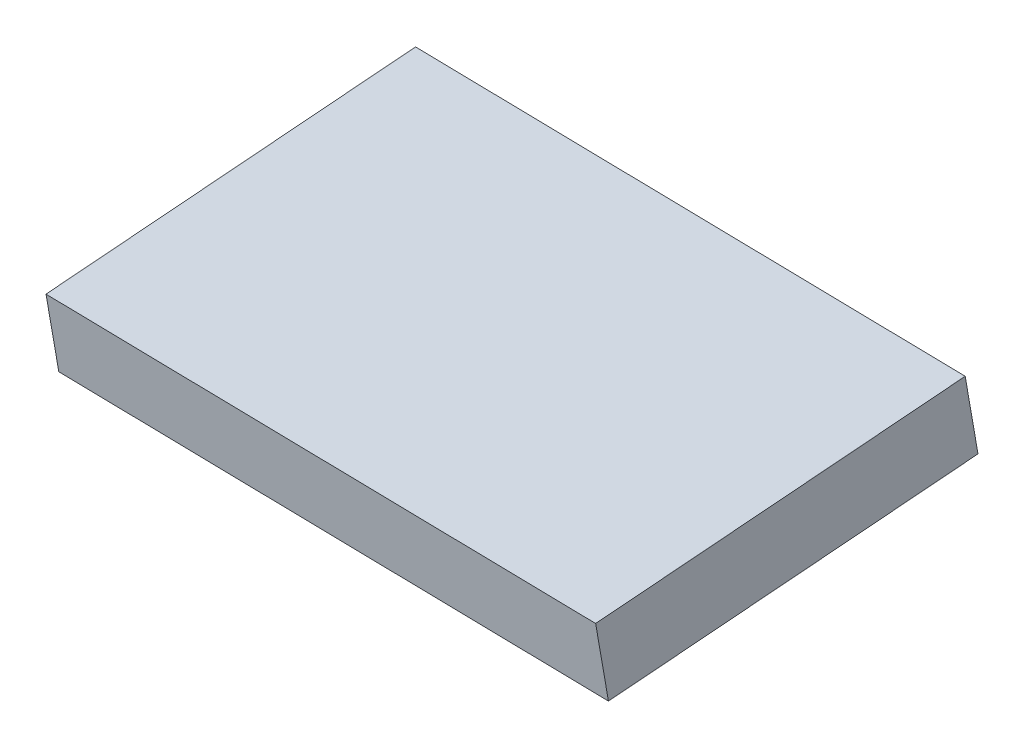
ISO-10303-21;
HEADER;
FILE_DESCRIPTION(('STEP AP214'),'2;1');
FILE_NAME('part.step','',(''),(''),'','','');
FILE_SCHEMA(('AUTOMOTIVE_DESIGN { 1 0 10303 214 1 1 1 1 }'));
ENDSEC;
DATA;
#1=APPLICATION_CONTEXT('core data for automotive mechanical design processes');
#2=APPLICATION_PROTOCOL_DEFINITION('international standard','automotive_design',2000,#1);
#3=PRODUCT_CONTEXT('',#1,'mechanical');
#4=PRODUCT('Part','Part','',(#3));
#5=PRODUCT_RELATED_PRODUCT_CATEGORY('part','',(#4));
#6=PRODUCT_DEFINITION_FORMATION('','',#4);
#7=PRODUCT_DEFINITION_CONTEXT('part definition',#1,'design');
#8=PRODUCT_DEFINITION('design','',#6,#7);
#9=PRODUCT_DEFINITION_SHAPE('','',#8);
#10=(LENGTH_UNIT() NAMED_UNIT(*) SI_UNIT(.MILLI.,.METRE.));
#11=(NAMED_UNIT(*) PLANE_ANGLE_UNIT() SI_UNIT($,.RADIAN.));
#12=(NAMED_UNIT(*) SI_UNIT($,.STERADIAN.) SOLID_ANGLE_UNIT());
#13=UNCERTAINTY_MEASURE_WITH_UNIT(LENGTH_MEASURE(1.E-05),#10,'distance_accuracy_value','');
#14=(GEOMETRIC_REPRESENTATION_CONTEXT(3) GLOBAL_UNCERTAINTY_ASSIGNED_CONTEXT((#13)) GLOBAL_UNIT_ASSIGNED_CONTEXT((#10,
#11,#12)) REPRESENTATION_CONTEXT('',''));
#15=CARTESIAN_POINT('',(0.,0.,0.));
#16=DIRECTION('',(0.,0.,1.));
#17=DIRECTION('',(1.,0.,0.));
#18=AXIS2_PLACEMENT_3D('',#15,#16,#17);
#19=CARTESIAN_POINT('',(6.04205053191705,502.2183131718,126.180705529089));
#20=DIRECTION('',(0.997472718226184,0.0405450658339127,0.0583461569513515));
#21=DIRECTION('',(0.0583941738534485,0.,-0.998293604336907));
#22=AXIS2_PLACEMENT_3D('',#19,#20,#21);
#23=PLANE('',#22);
#24=DIRECTION('',(-0.0523867977596558,-0.135065746400959,0.989450790878273));
#25=VECTOR('',#24,1.);
#26=CARTESIAN_POINT('',(6.11519935391046,500.709542902703,125.978622563627));
#27=LINE('',#26,#25);
#28=CARTESIAN_POINT('',(6.51438675283903,501.738743890279,118.439007537135));
#29=VERTEX_POINT('',#28);
#30=CARTESIAN_POINT('',(6.11519935391046,500.709542902703,125.978622563627));
#31=VERTEX_POINT('',#30);
#32=EDGE_CURVE('E100',#29,#31,#27,.T.);
#33=ORIENTED_EDGE('',*,*,#32,.F.);
#34=DIRECTION('',(0.0479979146938385,-0.990006738252662,-0.132600371037821));
#35=VECTOR('',#34,1.);
#36=CARTESIAN_POINT('',(6.44123793084562,503.247514159376,118.641090502596));
#37=LINE('',#36,#35);
#38=CARTESIAN_POINT('',(6.44123793084562,503.247514159376,118.641090502596));
#39=VERTEX_POINT('',#38);
#40=EDGE_CURVE('E11',#39,#29,#37,.T.);
#41=ORIENTED_EDGE('',*,*,#40,.F.);
#42=DIRECTION('',(-0.0523867977596558,-0.135065746400959,0.989450790878273));
#43=VECTOR('',#42,1.);
#44=CARTESIAN_POINT('',(6.04205053191705,502.2183131718,126.180705529089));
#45=LINE('',#44,#43);
#46=CARTESIAN_POINT('',(6.04205053191705,502.2183131718,126.180705529089));
#47=VERTEX_POINT('',#46);
#48=EDGE_CURVE('E94',#39,#47,#45,.T.);
#49=ORIENTED_EDGE('',*,*,#48,.T.);
#50=DIRECTION('',(0.0479979146938385,-0.990006738252662,-0.132600371037821));
#51=VECTOR('',#50,1.);
#52=CARTESIAN_POINT('',(6.04205053191705,502.2183131718,126.180705529089));
#53=LINE('',#52,#51);
#54=EDGE_CURVE('E39',#47,#31,#53,.T.);
#55=ORIENTED_EDGE('',*,*,#54,.T.);
#56=EDGE_LOOP('',(#33,#41,#49,#55));
#57=FACE_BOUND('',#56,.T.);
#58=ADVANCED_FACE('F36',(#57),#23,.T.);
#59=CARTESIAN_POINT('',(6.44123793084562,503.247514159376,118.641090502596));
#60=DIRECTION('',(0.0523867977596561,0.13506574640096,-0.989450790878273));
#61=DIRECTION('',(0.,0.990811304629671,0.135251464384124));
#62=AXIS2_PLACEMENT_3D('',#59,#60,#61);
#63=PLANE('',#62);
#64=DIRECTION('',(0.997472718226184,0.0405450658339065,0.0583461569513511));
#65=VECTOR('',#64,1.);
#66=CARTESIAN_POINT('',(6.51438675283903,501.738743890279,118.439007537135));
#67=LINE('',#66,#65);
#68=CARTESIAN_POINT('',(-6.02683773341877,501.228970777549,117.705421305785));
#69=VERTEX_POINT('',#68);
#70=EDGE_CURVE('E96',#69,#29,#67,.T.);
#71=ORIENTED_EDGE('',*,*,#70,.F.);
#72=DIRECTION('',(0.0479979146938385,-0.990006738252662,-0.132600371037821));
#73=VECTOR('',#72,1.);
#74=CARTESIAN_POINT('',(-6.09998655541218,502.737741046646,117.907504271247));
#75=LINE('',#74,#73);
#76=CARTESIAN_POINT('',(-6.09998655541218,502.737741046646,117.907504271247));
#77=VERTEX_POINT('',#76);
#78=EDGE_CURVE('E45',#77,#69,#75,.T.);
#79=ORIENTED_EDGE('',*,*,#78,.F.);
#80=DIRECTION('',(0.997472718226184,0.0405450658339065,0.0583461569513511));
#81=VECTOR('',#80,1.);
#82=CARTESIAN_POINT('',(6.44123793084562,503.247514159376,118.641090502596));
#83=LINE('',#82,#81);
#84=EDGE_CURVE('E91',#77,#39,#83,.T.);
#85=ORIENTED_EDGE('',*,*,#84,.T.);
#86=ORIENTED_EDGE('',*,*,#40,.T.);
#87=EDGE_LOOP('',(#71,#79,#85,#86));
#88=FACE_BOUND('',#87,.T.);
#89=ADVANCED_FACE('F110',(#88),#63,.T.);
#90=CARTESIAN_POINT('',(-6.09998655541218,502.737741046646,117.907504271247));
#91=DIRECTION('',(-0.997472718226184,-0.0405450658339126,-0.0583461569513524));
#92=DIRECTION('',(-0.0583941738534494,0.,0.998293604336907));
#93=AXIS2_PLACEMENT_3D('',#90,#91,#92);
#94=PLANE('',#93);
#95=DIRECTION('',(0.0523867977596567,0.135065746400959,-0.989450790878273));
#96=VECTOR('',#95,1.);
#97=CARTESIAN_POINT('',(-6.02683773341877,501.228970777549,117.705421305785));
#98=LINE('',#97,#96);
#99=CARTESIAN_POINT('',(-6.42602513234735,500.199769789974,125.245036332278));
#100=VERTEX_POINT('',#99);
#101=EDGE_CURVE('E86',#100,#69,#98,.T.);
#102=ORIENTED_EDGE('',*,*,#101,.F.);
#103=DIRECTION('',(0.0479979146938385,-0.990006738252662,-0.132600371037821));
#104=VECTOR('',#103,1.);
#105=CARTESIAN_POINT('',(-6.49917395434076,501.708540059071,125.447119297739));
#106=LINE('',#105,#104);
#107=CARTESIAN_POINT('',(-6.49917395434076,501.708540059071,125.447119297739));
#108=VERTEX_POINT('',#107);
#109=EDGE_CURVE('E81',#108,#100,#106,.T.);
#110=ORIENTED_EDGE('',*,*,#109,.F.);
#111=DIRECTION('',(0.0523867977596567,0.135065746400959,-0.989450790878273));
#112=VECTOR('',#111,1.);
#113=CARTESIAN_POINT('',(-6.09998655541218,502.737741046646,117.907504271247));
#114=LINE('',#113,#112);
#115=EDGE_CURVE('E84',#108,#77,#114,.T.);
#116=ORIENTED_EDGE('',*,*,#115,.T.);
#117=ORIENTED_EDGE('',*,*,#78,.T.);
#118=EDGE_LOOP('',(#102,#110,#116,#117));
#119=FACE_BOUND('',#118,.T.);
#120=ADVANCED_FACE('F83',(#119),#94,.T.);
#121=CARTESIAN_POINT('',(-6.49917395434076,501.708540059071,125.447119297739));
#122=DIRECTION('',(-0.0523867977596561,-0.13506574640096,0.989450790878273));
#123=DIRECTION('',(0.,-0.990811304629671,-0.135251464384124));
#124=AXIS2_PLACEMENT_3D('',#121,#122,#123);
#125=PLANE('',#124);
#126=DIRECTION('',(-0.997472718226184,-0.0405450658339064,-0.0583461569513511));
#127=VECTOR('',#126,1.);
#128=CARTESIAN_POINT('',(-6.42602513234735,500.199769789974,125.245036332278));
#129=LINE('',#128,#127);
#130=EDGE_CURVE('E103',#31,#100,#129,.T.);
#131=ORIENTED_EDGE('',*,*,#130,.F.);
#132=ORIENTED_EDGE('',*,*,#54,.F.);
#133=DIRECTION('',(-0.997472718226184,-0.0405450658339064,-0.0583461569513511));
#134=VECTOR('',#133,1.);
#135=CARTESIAN_POINT('',(-6.49917395434076,501.708540059071,125.447119297739));
#136=LINE('',#135,#134);
#137=EDGE_CURVE('E90',#47,#108,#136,.T.);
#138=ORIENTED_EDGE('',*,*,#137,.T.);
#139=ORIENTED_EDGE('',*,*,#109,.T.);
#140=EDGE_LOOP('',(#131,#132,#138,#139));
#141=FACE_BOUND('',#140,.T.);
#142=ADVANCED_FACE('F93',(#141),#125,.T.);
#143=CARTESIAN_POINT('',(-24.6537025006402,508.508166535966,68.1090026492549));
#144=DIRECTION('',(-0.0479979146938322,0.990006738252663,0.13260037103782));
#145=DIRECTION('',(0.,-0.132753377816505,0.991149101133784));
#146=AXIS2_PLACEMENT_3D('',#143,#144,#145);
#147=PLANE('',#146);
#148=ORIENTED_EDGE('',*,*,#48,.F.);
#149=ORIENTED_EDGE('',*,*,#84,.F.);
#150=ORIENTED_EDGE('',*,*,#115,.F.);
#151=ORIENTED_EDGE('',*,*,#137,.F.);
#152=EDGE_LOOP('',(#148,#149,#150,#151));
#153=FACE_BOUND('',#152,.T.);
#154=ADVANCED_FACE('F89',(#153),#147,.T.);
#155=CARTESIAN_POINT('',(-24.5805536786468,506.999396266869,67.9069196837932));
#156=DIRECTION('',(-0.0479979146938322,0.990006738252663,0.13260037103782));
#157=DIRECTION('',(0.,-0.132753377816505,0.991149101133784));
#158=AXIS2_PLACEMENT_3D('',#155,#156,#157);
#159=PLANE('',#158);
#160=ORIENTED_EDGE('',*,*,#32,.T.);
#161=ORIENTED_EDGE('',*,*,#130,.T.);
#162=ORIENTED_EDGE('',*,*,#101,.T.);
#163=ORIENTED_EDGE('',*,*,#70,.T.);
#164=EDGE_LOOP('',(#160,#161,#162,#163));
#165=FACE_BOUND('',#164,.T.);
#166=ADVANCED_FACE('F109',(#165),#159,.F.);
#167=CLOSED_SHELL('',(#58,#89,#120,#142,#154,#166));
#168=MANIFOLD_SOLID_BREP('B2',#167);
#169=ADVANCED_BREP_SHAPE_REPRESENTATION('',(#18,#168),#14);
#170=SHAPE_DEFINITION_REPRESENTATION(#9,#169);
ENDSEC;
END-ISO-10303-21;
